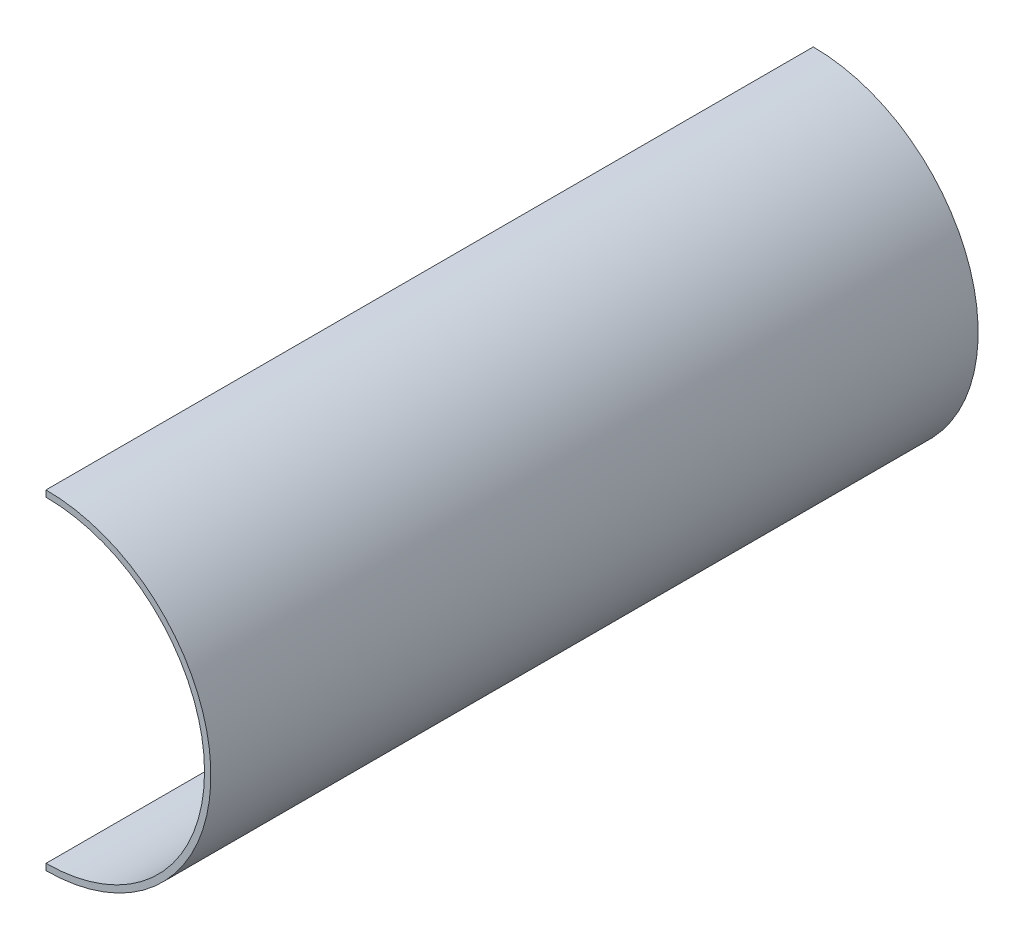
ISO-10303-21;
HEADER;
FILE_DESCRIPTION(('STEP AP214'),'2;1');
FILE_NAME('part.step','',(''),(''),'','','');
FILE_SCHEMA(('AUTOMOTIVE_DESIGN { 1 0 10303 214 1 1 1 1 }'));
ENDSEC;
DATA;
#1=APPLICATION_CONTEXT('core data for automotive mechanical design processes');
#2=APPLICATION_PROTOCOL_DEFINITION('international standard','automotive_design',2000,#1);
#3=PRODUCT_CONTEXT('',#1,'mechanical');
#4=PRODUCT('Part','Part','',(#3));
#5=PRODUCT_RELATED_PRODUCT_CATEGORY('part','',(#4));
#6=PRODUCT_DEFINITION_FORMATION('','',#4);
#7=PRODUCT_DEFINITION_CONTEXT('part definition',#1,'design');
#8=PRODUCT_DEFINITION('design','',#6,#7);
#9=PRODUCT_DEFINITION_SHAPE('','',#8);
#10=(LENGTH_UNIT() NAMED_UNIT(*) SI_UNIT(.MILLI.,.METRE.));
#11=(NAMED_UNIT(*) PLANE_ANGLE_UNIT() SI_UNIT($,.RADIAN.));
#12=(NAMED_UNIT(*) SI_UNIT($,.STERADIAN.) SOLID_ANGLE_UNIT());
#13=UNCERTAINTY_MEASURE_WITH_UNIT(LENGTH_MEASURE(1.E-05),#10,'distance_accuracy_value','');
#14=(GEOMETRIC_REPRESENTATION_CONTEXT(3) GLOBAL_UNCERTAINTY_ASSIGNED_CONTEXT((#13)) GLOBAL_UNIT_ASSIGNED_CONTEXT((#10,
#11,#12)) REPRESENTATION_CONTEXT('',''));
#15=CARTESIAN_POINT('',(0.,0.,0.));
#16=DIRECTION('',(0.,0.,1.));
#17=DIRECTION('',(1.,0.,0.));
#18=AXIS2_PLACEMENT_3D('',#15,#16,#17);
#19=CARTESIAN_POINT('',(50.,0.,242.));
#20=DIRECTION('',(0.,0.,-1.));
#21=DIRECTION('',(-1.,0.,0.));
#22=AXIS2_PLACEMENT_3D('',#19,#20,#21);
#23=CYLINDRICAL_SURFACE('',#22,50.);
#24=CARTESIAN_POINT('',(50.,0.,3.));
#25=DIRECTION('',(0.,0.,-1.));
#26=DIRECTION('',(-1.,0.,0.));
#27=AXIS2_PLACEMENT_3D('',#24,#25,#26);
#28=CIRCLE('',#27,49.9999999999998);
#29=CARTESIAN_POINT('',(50.,49.9999999999997,3.));
#30=VERTEX_POINT('',#29);
#31=CARTESIAN_POINT('',(50.,-49.9999999999999,3.));
#32=VERTEX_POINT('',#31);
#33=EDGE_CURVE('E115',#30,#32,#28,.T.);
#34=ORIENTED_EDGE('',*,*,#33,.T.);
#35=DIRECTION('',(0.,0.,-1.));
#36=VECTOR('',#35,1.);
#37=CARTESIAN_POINT('',(50.,-50.,242.));
#38=LINE('',#37,#36);
#39=CARTESIAN_POINT('',(50.,-50.,242.));
#40=VERTEX_POINT('',#39);
#41=EDGE_CURVE('E11',#40,#32,#38,.T.);
#42=ORIENTED_EDGE('',*,*,#41,.F.);
#43=CARTESIAN_POINT('',(50.,0.,242.));
#44=DIRECTION('',(0.,0.,-1.));
#45=DIRECTION('',(-1.,0.,0.));
#46=AXIS2_PLACEMENT_3D('',#43,#44,#45);
#47=CIRCLE('',#46,50.);
#48=CARTESIAN_POINT('',(50.,49.9999999999997,242.));
#49=VERTEX_POINT('',#48);
#50=EDGE_CURVE('E58',#49,#40,#47,.T.);
#51=ORIENTED_EDGE('',*,*,#50,.F.);
#52=DIRECTION('',(0.,0.,-1.));
#53=VECTOR('',#52,1.);
#54=CARTESIAN_POINT('',(50.,49.9999999999997,242.));
#55=LINE('',#54,#53);
#56=EDGE_CURVE('E121',#49,#30,#55,.T.);
#57=ORIENTED_EDGE('',*,*,#56,.T.);
#58=EDGE_LOOP('',(#34,#42,#51,#57));
#59=FACE_BOUND('',#58,.T.);
#60=ADVANCED_FACE('F34',(#59),#23,.F.);
#61=CARTESIAN_POINT('',(50.,-50.,242.));
#62=DIRECTION('',(1.,0.,0.));
#63=DIRECTION('',(0.,0.,-1.));
#64=AXIS2_PLACEMENT_3D('',#61,#62,#63);
#65=PLANE('',#64);
#66=DIRECTION('',(0.,-1.,0.));
#67=VECTOR('',#66,1.);
#68=CARTESIAN_POINT('',(50.,-50.,0.));
#69=LINE('',#68,#67);
#70=CARTESIAN_POINT('',(50.,-50.,0.));
#71=VERTEX_POINT('',#70);
#72=CARTESIAN_POINT('',(50.,-51.9999999999999,0.));
#73=VERTEX_POINT('',#72);
#74=EDGE_CURVE('E125',#71,#73,#69,.T.);
#75=ORIENTED_EDGE('',*,*,#74,.T.);
#76=DIRECTION('',(0.,0.,-1.));
#77=VECTOR('',#76,1.);
#78=CARTESIAN_POINT('',(50.,-51.9999999999999,242.));
#79=LINE('',#78,#77);
#80=CARTESIAN_POINT('',(50.,-51.9999999999999,242.));
#81=VERTEX_POINT('',#80);
#82=EDGE_CURVE('E154',#81,#73,#79,.T.);
#83=ORIENTED_EDGE('',*,*,#82,.F.);
#84=DIRECTION('',(0.,-1.,0.));
#85=VECTOR('',#84,1.);
#86=CARTESIAN_POINT('',(50.,-50.,242.));
#87=LINE('',#86,#85);
#88=EDGE_CURVE('E87',#40,#81,#87,.T.);
#89=ORIENTED_EDGE('',*,*,#88,.F.);
#90=ORIENTED_EDGE('',*,*,#41,.T.);
#91=DIRECTION('',(0.,1.,0.));
#92=VECTOR('',#91,1.);
#93=CARTESIAN_POINT('',(50.,-48.,3.));
#94=LINE('',#93,#92);
#95=CARTESIAN_POINT('',(50.,-48.,3.));
#96=VERTEX_POINT('',#95);
#97=EDGE_CURVE('E111',#32,#96,#94,.T.);
#98=ORIENTED_EDGE('',*,*,#97,.T.);
#99=DIRECTION('',(0.,0.,-1.));
#100=VECTOR('',#99,1.);
#101=CARTESIAN_POINT('',(50.,-48.,3.));
#102=LINE('',#101,#100);
#103=CARTESIAN_POINT('',(50.,-48.,2.));
#104=VERTEX_POINT('',#103);
#105=EDGE_CURVE('E175',#96,#104,#102,.T.);
#106=ORIENTED_EDGE('',*,*,#105,.T.);
#107=DIRECTION('',(0.,1.,0.));
#108=VECTOR('',#107,1.);
#109=CARTESIAN_POINT('',(50.,-48.,2.));
#110=LINE('',#109,#108);
#111=CARTESIAN_POINT('',(50.,-49.9999999999999,2.));
#112=VERTEX_POINT('',#111);
#113=EDGE_CURVE('E182',#112,#104,#110,.T.);
#114=ORIENTED_EDGE('',*,*,#113,.F.);
#115=EDGE_CURVE('E42',#112,#71,#38,.T.);
#116=ORIENTED_EDGE('',*,*,#115,.T.);
#117=EDGE_LOOP('',(#75,#83,#89,#90,#98,#106,#114,#116));
#118=FACE_BOUND('',#117,.T.);
#119=ADVANCED_FACE('F36',(#118),#65,.F.);
#120=CARTESIAN_POINT('',(50.,0.,242.));
#121=DIRECTION('',(0.,0.,-1.));
#122=DIRECTION('',(-1.,0.,0.));
#123=AXIS2_PLACEMENT_3D('',#120,#121,#122);
#124=CYLINDRICAL_SURFACE('',#123,52.);
#125=CARTESIAN_POINT('',(50.,0.,0.));
#126=DIRECTION('',(0.,0.,1.));
#127=DIRECTION('',(1.,0.,0.));
#128=AXIS2_PLACEMENT_3D('',#125,#126,#127);
#129=CIRCLE('',#128,52.);
#130=CARTESIAN_POINT('',(50.,52.,0.));
#131=VERTEX_POINT('',#130);
#132=EDGE_CURVE('E165',#73,#131,#129,.T.);
#133=ORIENTED_EDGE('',*,*,#132,.T.);
#134=DIRECTION('',(0.,0.,-1.));
#135=VECTOR('',#134,1.);
#136=CARTESIAN_POINT('',(50.,52.,242.));
#137=LINE('',#136,#135);
#138=CARTESIAN_POINT('',(50.,52.,242.));
#139=VERTEX_POINT('',#138);
#140=EDGE_CURVE('E155',#139,#131,#137,.T.);
#141=ORIENTED_EDGE('',*,*,#140,.F.);
#142=CARTESIAN_POINT('',(50.,0.,242.));
#143=DIRECTION('',(0.,0.,1.));
#144=DIRECTION('',(1.,0.,0.));
#145=AXIS2_PLACEMENT_3D('',#142,#143,#144);
#146=CIRCLE('',#145,51.9999999999999);
#147=EDGE_CURVE('E171',#81,#139,#146,.T.);
#148=ORIENTED_EDGE('',*,*,#147,.F.);
#149=ORIENTED_EDGE('',*,*,#82,.T.);
#150=EDGE_LOOP('',(#133,#141,#148,#149));
#151=FACE_BOUND('',#150,.T.);
#152=ADVANCED_FACE('F128',(#151),#124,.T.);
#153=CARTESIAN_POINT('',(50.,52.,242.));
#154=DIRECTION('',(1.,0.,0.));
#155=DIRECTION('',(0.,0.,-1.));
#156=AXIS2_PLACEMENT_3D('',#153,#154,#155);
#157=PLANE('',#156);
#158=DIRECTION('',(0.,-1.,0.));
#159=VECTOR('',#158,1.);
#160=CARTESIAN_POINT('',(50.,52.,0.));
#161=LINE('',#160,#159);
#162=CARTESIAN_POINT('',(50.,49.9999999999997,0.));
#163=VERTEX_POINT('',#162);
#164=EDGE_CURVE('E162',#131,#163,#161,.T.);
#165=ORIENTED_EDGE('',*,*,#164,.T.);
#166=CARTESIAN_POINT('',(50.,49.9999999999997,2.));
#167=VERTEX_POINT('',#166);
#168=EDGE_CURVE('E80',#167,#163,#55,.T.);
#169=ORIENTED_EDGE('',*,*,#168,.F.);
#170=DIRECTION('',(0.,1.,0.));
#171=VECTOR('',#170,1.);
#172=CARTESIAN_POINT('',(50.,49.9999999999997,2.));
#173=LINE('',#172,#171);
#174=CARTESIAN_POINT('',(50.,48.,2.));
#175=VERTEX_POINT('',#174);
#176=EDGE_CURVE('E49',#175,#167,#173,.T.);
#177=ORIENTED_EDGE('',*,*,#176,.F.);
#178=DIRECTION('',(0.,0.,-1.));
#179=VECTOR('',#178,1.);
#180=CARTESIAN_POINT('',(50.,48.,3.));
#181=LINE('',#180,#179);
#182=CARTESIAN_POINT('',(50.,48.,3.));
#183=VERTEX_POINT('',#182);
#184=EDGE_CURVE('E168',#183,#175,#181,.T.);
#185=ORIENTED_EDGE('',*,*,#184,.F.);
#186=DIRECTION('',(0.,1.,0.));
#187=VECTOR('',#186,1.);
#188=CARTESIAN_POINT('',(50.,49.9999999999997,3.));
#189=LINE('',#188,#187);
#190=EDGE_CURVE('E177',#183,#30,#189,.T.);
#191=ORIENTED_EDGE('',*,*,#190,.T.);
#192=ORIENTED_EDGE('',*,*,#56,.F.);
#193=DIRECTION('',(0.,-1.,0.));
#194=VECTOR('',#193,1.);
#195=CARTESIAN_POINT('',(50.,52.,242.));
#196=LINE('',#195,#194);
#197=EDGE_CURVE('E169',#139,#49,#196,.T.);
#198=ORIENTED_EDGE('',*,*,#197,.F.);
#199=ORIENTED_EDGE('',*,*,#140,.T.);
#200=EDGE_LOOP('',(#165,#169,#177,#185,#191,#192,#198,#199));
#201=FACE_BOUND('',#200,.T.);
#202=ADVANCED_FACE('F133',(#201),#157,.F.);
#203=ORIENTED_EDGE('',*,*,#115,.F.);
#204=CARTESIAN_POINT('',(50.,0.,2.));
#205=DIRECTION('',(0.,0.,-1.));
#206=DIRECTION('',(-1.,0.,0.));
#207=AXIS2_PLACEMENT_3D('',#204,#205,#206);
#208=CIRCLE('',#207,49.9999999999998);
#209=EDGE_CURVE('E152',#167,#112,#208,.T.);
#210=ORIENTED_EDGE('',*,*,#209,.F.);
#211=ORIENTED_EDGE('',*,*,#168,.T.);
#212=CARTESIAN_POINT('',(50.,0.,0.));
#213=DIRECTION('',(0.,0.,-1.));
#214=DIRECTION('',(-1.,0.,0.));
#215=AXIS2_PLACEMENT_3D('',#212,#213,#214);
#216=CIRCLE('',#215,50.);
#217=EDGE_CURVE('E153',#163,#71,#216,.T.);
#218=ORIENTED_EDGE('',*,*,#217,.T.);
#219=EDGE_LOOP('',(#203,#210,#211,#218));
#220=FACE_BOUND('',#219,.T.);
#221=ADVANCED_FACE('F136',(#220),#23,.F.);
#222=CARTESIAN_POINT('',(50.,0.,242.));
#223=DIRECTION('',(0.,0.,-1.));
#224=DIRECTION('',(-1.,0.,0.));
#225=AXIS2_PLACEMENT_3D('',#222,#223,#224);
#226=PLANE('',#225);
#227=ORIENTED_EDGE('',*,*,#50,.T.);
#228=ORIENTED_EDGE('',*,*,#88,.T.);
#229=ORIENTED_EDGE('',*,*,#147,.T.);
#230=ORIENTED_EDGE('',*,*,#197,.T.);
#231=EDGE_LOOP('',(#227,#228,#229,#230));
#232=FACE_BOUND('',#231,.T.);
#233=ADVANCED_FACE('F142',(#232),#226,.F.);
#234=CARTESIAN_POINT('',(50.,0.,0.));
#235=DIRECTION('',(0.,0.,-1.));
#236=DIRECTION('',(-1.,0.,0.));
#237=AXIS2_PLACEMENT_3D('',#234,#235,#236);
#238=PLANE('',#237);
#239=ORIENTED_EDGE('',*,*,#74,.F.);
#240=ORIENTED_EDGE('',*,*,#217,.F.);
#241=ORIENTED_EDGE('',*,*,#164,.F.);
#242=ORIENTED_EDGE('',*,*,#132,.F.);
#243=EDGE_LOOP('',(#239,#240,#241,#242));
#244=FACE_BOUND('',#243,.T.);
#245=ADVANCED_FACE('F147',(#244),#238,.T.);
#246=CARTESIAN_POINT('',(50.,0.,3.));
#247=DIRECTION('',(0.,0.,-1.));
#248=DIRECTION('',(-1.,0.,0.));
#249=AXIS2_PLACEMENT_3D('',#246,#247,#248);
#250=CYLINDRICAL_SURFACE('',#249,48.);
#251=CARTESIAN_POINT('',(50.,0.,2.));
#252=DIRECTION('',(0.,0.,1.));
#253=DIRECTION('',(1.,0.,0.));
#254=AXIS2_PLACEMENT_3D('',#251,#252,#253);
#255=CIRCLE('',#254,48.);
#256=EDGE_CURVE('E180',#104,#175,#255,.T.);
#257=ORIENTED_EDGE('',*,*,#256,.F.);
#258=ORIENTED_EDGE('',*,*,#105,.F.);
#259=CARTESIAN_POINT('',(50.,0.,3.));
#260=DIRECTION('',(0.,0.,1.));
#261=DIRECTION('',(1.,0.,0.));
#262=AXIS2_PLACEMENT_3D('',#259,#260,#261);
#263=CIRCLE('',#262,48.);
#264=EDGE_CURVE('E118',#96,#183,#263,.T.);
#265=ORIENTED_EDGE('',*,*,#264,.T.);
#266=ORIENTED_EDGE('',*,*,#184,.T.);
#267=EDGE_LOOP('',(#257,#258,#265,#266));
#268=FACE_BOUND('',#267,.T.);
#269=ADVANCED_FACE('F189',(#268),#250,.F.);
#270=CARTESIAN_POINT('',(50.,0.,3.));
#271=DIRECTION('',(0.,0.,-1.));
#272=DIRECTION('',(-1.,0.,0.));
#273=AXIS2_PLACEMENT_3D('',#270,#271,#272);
#274=PLANE('',#273);
#275=ORIENTED_EDGE('',*,*,#33,.F.);
#276=ORIENTED_EDGE('',*,*,#190,.F.);
#277=ORIENTED_EDGE('',*,*,#264,.F.);
#278=ORIENTED_EDGE('',*,*,#97,.F.);
#279=EDGE_LOOP('',(#275,#276,#277,#278));
#280=FACE_BOUND('',#279,.T.);
#281=ADVANCED_FACE('F113',(#280),#274,.F.);
#282=CARTESIAN_POINT('',(50.,0.,2.));
#283=DIRECTION('',(0.,0.,-1.));
#284=DIRECTION('',(-1.,0.,0.));
#285=AXIS2_PLACEMENT_3D('',#282,#283,#284);
#286=PLANE('',#285);
#287=ORIENTED_EDGE('',*,*,#209,.T.);
#288=ORIENTED_EDGE('',*,*,#113,.T.);
#289=ORIENTED_EDGE('',*,*,#256,.T.);
#290=ORIENTED_EDGE('',*,*,#176,.T.);
#291=EDGE_LOOP('',(#287,#288,#289,#290));
#292=FACE_BOUND('',#291,.T.);
#293=ADVANCED_FACE('F200',(#292),#286,.T.);
#294=CLOSED_SHELL('',(#60,#119,#152,#202,#221,#233,#245,#269,#281,#293));
#295=MANIFOLD_SOLID_BREP('B2',#294);
#296=ADVANCED_BREP_SHAPE_REPRESENTATION('',(#18,#295),#14);
#297=SHAPE_DEFINITION_REPRESENTATION(#9,#296);
ENDSEC;
END-ISO-10303-21;
